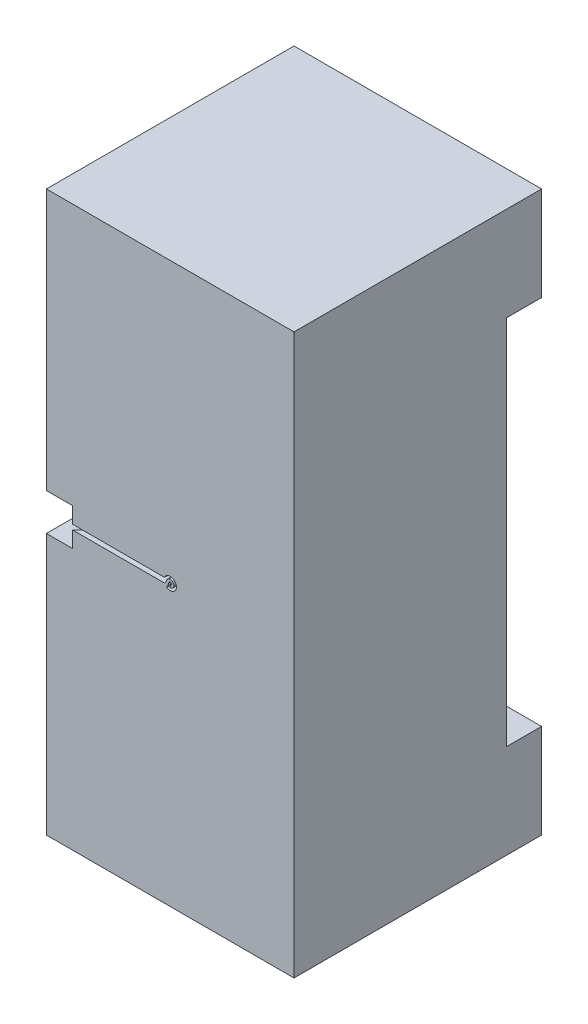
ISO-10303-21;
HEADER;
FILE_DESCRIPTION(('STEP AP214'),'2;1');
FILE_NAME('part.step','',(''),(''),'','','');
FILE_SCHEMA(('AUTOMOTIVE_DESIGN { 1 0 10303 214 1 1 1 1 }'));
ENDSEC;
DATA;
#1=APPLICATION_CONTEXT('core data for automotive mechanical design processes');
#2=APPLICATION_PROTOCOL_DEFINITION('international standard','automotive_design',2000,#1);
#3=PRODUCT_CONTEXT('',#1,'mechanical');
#4=PRODUCT('Part','Part','',(#3));
#5=PRODUCT_RELATED_PRODUCT_CATEGORY('part','',(#4));
#6=PRODUCT_DEFINITION_FORMATION('','',#4);
#7=PRODUCT_DEFINITION_CONTEXT('part definition',#1,'design');
#8=PRODUCT_DEFINITION('design','',#6,#7);
#9=PRODUCT_DEFINITION_SHAPE('','',#8);
#10=(LENGTH_UNIT() NAMED_UNIT(*) SI_UNIT(.MILLI.,.METRE.));
#11=(NAMED_UNIT(*) PLANE_ANGLE_UNIT() SI_UNIT($,.RADIAN.));
#12=(NAMED_UNIT(*) SI_UNIT($,.STERADIAN.) SOLID_ANGLE_UNIT());
#13=UNCERTAINTY_MEASURE_WITH_UNIT(LENGTH_MEASURE(1.E-05),#10,'distance_accuracy_value','');
#14=(GEOMETRIC_REPRESENTATION_CONTEXT(3) GLOBAL_UNCERTAINTY_ASSIGNED_CONTEXT((#13)) GLOBAL_UNIT_ASSIGNED_CONTEXT((#10,
#11,#12)) REPRESENTATION_CONTEXT('',''));
#15=CARTESIAN_POINT('',(0.,0.,0.));
#16=DIRECTION('',(0.,0.,1.));
#17=DIRECTION('',(1.,0.,0.));
#18=AXIS2_PLACEMENT_3D('',#15,#16,#17);
#19=CARTESIAN_POINT('',(0.,113.,42.5));
#20=DIRECTION('',(0.,0.,1.));
#21=DIRECTION('',(1.,0.,0.));
#22=AXIS2_PLACEMENT_3D('',#19,#20,#21);
#23=CYLINDRICAL_SURFACE('',#22,2.5);
#24=DIRECTION('',(0.,0.,1.));
#25=VECTOR('',#24,1.);
#26=CARTESIAN_POINT('',(-1.41841628653395,110.941336540836,37.3001972000835));
#27=LINE('',#26,#25);
#28=CARTESIAN_POINT('',(-1.41841628653394,110.941336540836,43.5));
#29=VERTEX_POINT('',#28);
#30=CARTESIAN_POINT('',(-1.41841628653395,110.941336540836,50.));
#31=VERTEX_POINT('',#30);
#32=EDGE_CURVE('E66',#29,#31,#27,.T.);
#33=ORIENTED_EDGE('',*,*,#32,.T.);
#34=CARTESIAN_POINT('',(0.,113.,50.));
#35=DIRECTION('',(0.,0.,1.));
#36=DIRECTION('',(1.,0.,0.));
#37=AXIS2_PLACEMENT_3D('',#34,#35,#36);
#38=CIRCLE('',#37,2.5);
#39=CARTESIAN_POINT('',(-2.29128784747792,114.,50.));
#40=VERTEX_POINT('',#39);
#41=EDGE_CURVE('E238',#31,#40,#38,.T.);
#42=ORIENTED_EDGE('',*,*,#41,.T.);
#43=DIRECTION('',(0.,0.,1.));
#44=VECTOR('',#43,1.);
#45=CARTESIAN_POINT('',(-2.29128784747792,114.,42.5));
#46=LINE('',#45,#44);
#47=CARTESIAN_POINT('',(-2.29128784747792,114.,42.5));
#48=VERTEX_POINT('',#47);
#49=EDGE_CURVE('E274',#48,#40,#46,.T.);
#50=ORIENTED_EDGE('',*,*,#49,.F.);
#51=CARTESIAN_POINT('',(0.,113.,42.5));
#52=DIRECTION('',(0.,0.,1.));
#53=DIRECTION('',(1.,0.,0.));
#54=AXIS2_PLACEMENT_3D('',#51,#52,#53);
#55=CIRCLE('',#54,2.5);
#56=CARTESIAN_POINT('',(-2.29128784747792,112.,42.5));
#57=VERTEX_POINT('',#56);
#58=EDGE_CURVE('E263',#57,#48,#55,.T.);
#59=ORIENTED_EDGE('',*,*,#58,.F.);
#60=DIRECTION('',(0.,0.,1.));
#61=VECTOR('',#60,1.);
#62=CARTESIAN_POINT('',(-2.29128784747792,112.,42.5));
#63=LINE('',#62,#61);
#64=CARTESIAN_POINT('',(-2.29128784747792,112.,43.5));
#65=VERTEX_POINT('',#64);
#66=EDGE_CURVE('E269',#57,#65,#63,.T.);
#67=ORIENTED_EDGE('',*,*,#66,.T.);
#68=CARTESIAN_POINT('',(0.,113.,43.5));
#69=DIRECTION('',(0.,0.,1.));
#70=DIRECTION('',(1.,0.,0.));
#71=AXIS2_PLACEMENT_3D('',#68,#69,#70);
#72=CIRCLE('',#71,2.5);
#73=EDGE_CURVE('E61',#65,#29,#72,.T.);
#74=ORIENTED_EDGE('',*,*,#73,.T.);
#75=EDGE_LOOP('',(#33,#42,#50,#59,#67,#74));
#76=FACE_BOUND('',#75,.T.);
#77=ADVANCED_FACE('F46',(#76),#23,.F.);
#78=CARTESIAN_POINT('',(43.6916485072176,120.5,-33.0850467894194));
#79=DIRECTION('',(0.707106781186548,0.,0.707106781186547));
#80=DIRECTION('',(0.707106781186547,0.,-0.707106781186548));
#81=AXIS2_PLACEMENT_3D('',#78,#79,#80);
#82=PLANE('',#81);
#83=DIRECTION('',(0.707106781186547,0.,-0.707106781186548));
#84=VECTOR('',#83,1.);
#85=CARTESIAN_POINT('',(43.6916485072176,114.,-33.0850467894193));
#86=LINE('',#85,#84);
#87=CARTESIAN_POINT('',(-39.3933982822017,114.,50.));
#88=VERTEX_POINT('',#87);
#89=CARTESIAN_POINT('',(-33.0850467894193,114.,43.6916485072175));
#90=VERTEX_POINT('',#89);
#91=EDGE_CURVE('E403',#88,#90,#86,.T.);
#92=ORIENTED_EDGE('',*,*,#91,.F.);
#93=DIRECTION('',(0.,-1.,0.));
#94=VECTOR('',#93,1.);
#95=CARTESIAN_POINT('',(-39.3933982822017,226.,50.));
#96=LINE('',#95,#94);
#97=CARTESIAN_POINT('',(-39.3933982822017,120.5,50.));
#98=VERTEX_POINT('',#97);
#99=EDGE_CURVE('E307',#98,#88,#96,.T.);
#100=ORIENTED_EDGE('',*,*,#99,.F.);
#101=DIRECTION('',(-0.707106781186547,0.,0.707106781186548));
#102=VECTOR('',#101,1.);
#103=CARTESIAN_POINT('',(43.6916485072176,120.5,-33.0850467894194));
#104=LINE('',#103,#102);
#105=CARTESIAN_POINT('',(-33.0850467894193,120.5,43.6916485072175));
#106=VERTEX_POINT('',#105);
#107=EDGE_CURVE('E293',#106,#98,#104,.T.);
#108=ORIENTED_EDGE('',*,*,#107,.F.);
#109=DIRECTION('',(0.,1.,0.));
#110=VECTOR('',#109,1.);
#111=CARTESIAN_POINT('',(-33.0850467894193,0.,43.6916485072175));
#112=LINE('',#111,#110);
#113=EDGE_CURVE('E393',#90,#106,#112,.T.);
#114=ORIENTED_EDGE('',*,*,#113,.F.);
#115=EDGE_LOOP('',(#92,#100,#108,#114));
#116=FACE_BOUND('',#115,.T.);
#117=ADVANCED_FACE('F457',(#116),#82,.F.);
#118=CARTESIAN_POINT('',(50.,226.,-50.));
#119=DIRECTION('',(-1.,0.,0.));
#120=DIRECTION('',(0.,0.,1.));
#121=AXIS2_PLACEMENT_3D('',#118,#119,#120);
#122=PLANE('',#121);
#123=DIRECTION('',(0.,-1.,0.));
#124=VECTOR('',#123,1.);
#125=CARTESIAN_POINT('',(50.,226.,-50.));
#126=LINE('',#125,#124);
#127=CARTESIAN_POINT('',(50.0000000000001,38.,-50.));
#128=VERTEX_POINT('',#127);
#129=CARTESIAN_POINT('',(50.,0.,-50.));
#130=VERTEX_POINT('',#129);
#131=EDGE_CURVE('E376',#128,#130,#126,.T.);
#132=ORIENTED_EDGE('',*,*,#131,.F.);
#133=DIRECTION('',(0.,0.,1.));
#134=VECTOR('',#133,1.);
#135=CARTESIAN_POINT('',(50.,38.,-50.));
#136=LINE('',#135,#134);
#137=CARTESIAN_POINT('',(50.,38.,-35.8578643762691));
#138=VERTEX_POINT('',#137);
#139=EDGE_CURVE('E344',#128,#138,#136,.T.);
#140=ORIENTED_EDGE('',*,*,#139,.T.);
#141=DIRECTION('',(0.,-1.,0.));
#142=VECTOR('',#141,1.);
#143=CARTESIAN_POINT('',(50.,226.,-35.8578643762692));
#144=LINE('',#143,#142);
#145=CARTESIAN_POINT('',(50.,188.,-35.8578643762691));
#146=VERTEX_POINT('',#145);
#147=EDGE_CURVE('E388',#146,#138,#144,.T.);
#148=ORIENTED_EDGE('',*,*,#147,.F.);
#149=DIRECTION('',(0.,0.,1.));
#150=VECTOR('',#149,1.);
#151=CARTESIAN_POINT('',(50.,188.,-50.));
#152=LINE('',#151,#150);
#153=CARTESIAN_POINT('',(50.0000000000001,188.,-50.));
#154=VERTEX_POINT('',#153);
#155=EDGE_CURVE('E342',#154,#146,#152,.T.);
#156=ORIENTED_EDGE('',*,*,#155,.F.);
#157=CARTESIAN_POINT('',(50.,226.,-50.));
#158=VERTEX_POINT('',#157);
#159=EDGE_CURVE('E377',#158,#154,#126,.T.);
#160=ORIENTED_EDGE('',*,*,#159,.F.);
#161=DIRECTION('',(0.,0.,-1.));
#162=VECTOR('',#161,1.);
#163=CARTESIAN_POINT('',(50.,226.,-50.));
#164=LINE('',#163,#162);
#165=CARTESIAN_POINT('',(50.,226.,50.));
#166=VERTEX_POINT('',#165);
#167=EDGE_CURVE('E348',#166,#158,#164,.T.);
#168=ORIENTED_EDGE('',*,*,#167,.F.);
#169=DIRECTION('',(0.,-1.,0.));
#170=VECTOR('',#169,1.);
#171=CARTESIAN_POINT('',(50.,226.,50.));
#172=LINE('',#171,#170);
#173=CARTESIAN_POINT('',(50.,0.,50.));
#174=VERTEX_POINT('',#173);
#175=EDGE_CURVE('E358',#166,#174,#172,.T.);
#176=ORIENTED_EDGE('',*,*,#175,.T.);
#177=DIRECTION('',(0.,0.,-1.));
#178=VECTOR('',#177,1.);
#179=CARTESIAN_POINT('',(50.,0.,-50.));
#180=LINE('',#179,#178);
#181=EDGE_CURVE('E347',#174,#130,#180,.T.);
#182=ORIENTED_EDGE('',*,*,#181,.T.);
#183=EDGE_LOOP('',(#132,#140,#148,#156,#160,#168,#176,#182));
#184=FACE_BOUND('',#183,.T.);
#185=ADVANCED_FACE('F48',(#184),#122,.F.);
#186=CARTESIAN_POINT('',(-50.,226.,-50.));
#187=DIRECTION('',(0.,0.,1.));
#188=DIRECTION('',(1.,0.,0.));
#189=AXIS2_PLACEMENT_3D('',#186,#187,#188);
#190=PLANE('',#189);
#191=DIRECTION('',(0.,-1.,0.));
#192=VECTOR('',#191,1.);
#193=CARTESIAN_POINT('',(35.857864376269,226.,-50.));
#194=LINE('',#193,#192);
#195=CARTESIAN_POINT('',(35.857864376269,188.,-50.));
#196=VERTEX_POINT('',#195);
#197=CARTESIAN_POINT('',(35.857864376269,38.,-50.));
#198=VERTEX_POINT('',#197);
#199=EDGE_CURVE('E380',#196,#198,#194,.T.);
#200=ORIENTED_EDGE('',*,*,#199,.T.);
#201=DIRECTION('',(1.,0.,0.));
#202=VECTOR('',#201,1.);
#203=CARTESIAN_POINT('',(-50.,38.,-50.));
#204=LINE('',#203,#202);
#205=EDGE_CURVE('E385',#198,#128,#204,.T.);
#206=ORIENTED_EDGE('',*,*,#205,.T.);
#207=ORIENTED_EDGE('',*,*,#131,.T.);
#208=DIRECTION('',(-1.,0.,0.));
#209=VECTOR('',#208,1.);
#210=CARTESIAN_POINT('',(-50.,0.,-50.));
#211=LINE('',#210,#209);
#212=CARTESIAN_POINT('',(-50.,0.,-50.));
#213=VERTEX_POINT('',#212);
#214=EDGE_CURVE('E361',#130,#213,#211,.T.);
#215=ORIENTED_EDGE('',*,*,#214,.T.);
#216=DIRECTION('',(0.,-1.,0.));
#217=VECTOR('',#216,1.);
#218=CARTESIAN_POINT('',(-50.,226.,-50.));
#219=LINE('',#218,#217);
#220=CARTESIAN_POINT('',(-50.,226.,-50.));
#221=VERTEX_POINT('',#220);
#222=EDGE_CURVE('E373',#221,#213,#219,.T.);
#223=ORIENTED_EDGE('',*,*,#222,.F.);
#224=DIRECTION('',(-1.,0.,0.));
#225=VECTOR('',#224,1.);
#226=CARTESIAN_POINT('',(-50.,226.,-50.));
#227=LINE('',#226,#225);
#228=EDGE_CURVE('E351',#158,#221,#227,.T.);
#229=ORIENTED_EDGE('',*,*,#228,.F.);
#230=ORIENTED_EDGE('',*,*,#159,.T.);
#231=DIRECTION('',(1.,0.,0.));
#232=VECTOR('',#231,1.);
#233=CARTESIAN_POINT('',(-50.,188.,-50.));
#234=LINE('',#233,#232);
#235=EDGE_CURVE('E383',#196,#154,#234,.T.);
#236=ORIENTED_EDGE('',*,*,#235,.F.);
#237=EDGE_LOOP('',(#200,#206,#207,#215,#223,#229,#230,#236));
#238=FACE_BOUND('',#237,.T.);
#239=ADVANCED_FACE('F509',(#238),#190,.F.);
#240=CARTESIAN_POINT('',(-50.,226.,-50.));
#241=DIRECTION('',(1.,0.,0.));
#242=DIRECTION('',(0.,0.,-1.));
#243=AXIS2_PLACEMENT_3D('',#240,#241,#242);
#244=PLANE('',#243);
#245=DIRECTION('',(0.,1.,0.));
#246=VECTOR('',#245,1.);
#247=CARTESIAN_POINT('',(-50.,226.,39.3933982822018));
#248=LINE('',#247,#246);
#249=CARTESIAN_POINT('',(-50.,105.5,39.3933982822018));
#250=VERTEX_POINT('',#249);
#251=CARTESIAN_POINT('',(-50.,120.5,39.3933982822018));
#252=VERTEX_POINT('',#251);
#253=EDGE_CURVE('E316',#250,#252,#248,.T.);
#254=ORIENTED_EDGE('',*,*,#253,.T.);
#255=DIRECTION('',(0.,0.,1.));
#256=VECTOR('',#255,1.);
#257=CARTESIAN_POINT('',(-50.,120.5,-50.));
#258=LINE('',#257,#256);
#259=CARTESIAN_POINT('',(-50.,120.5,50.));
#260=VERTEX_POINT('',#259);
#261=EDGE_CURVE('E313',#252,#260,#258,.T.);
#262=ORIENTED_EDGE('',*,*,#261,.T.);
#263=DIRECTION('',(0.,-1.,0.));
#264=VECTOR('',#263,1.);
#265=CARTESIAN_POINT('',(-50.,226.,50.));
#266=LINE('',#265,#264);
#267=CARTESIAN_POINT('',(-50.,226.,50.));
#268=VERTEX_POINT('',#267);
#269=EDGE_CURVE('E370',#268,#260,#266,.T.);
#270=ORIENTED_EDGE('',*,*,#269,.F.);
#271=DIRECTION('',(0.,0.,1.));
#272=VECTOR('',#271,1.);
#273=CARTESIAN_POINT('',(-50.,226.,-50.));
#274=LINE('',#273,#272);
#275=EDGE_CURVE('E354',#221,#268,#274,.T.);
#276=ORIENTED_EDGE('',*,*,#275,.F.);
#277=ORIENTED_EDGE('',*,*,#222,.T.);
#278=DIRECTION('',(0.,0.,1.));
#279=VECTOR('',#278,1.);
#280=CARTESIAN_POINT('',(-50.,0.,-50.));
#281=LINE('',#280,#279);
#282=CARTESIAN_POINT('',(-50.,0.,50.));
#283=VERTEX_POINT('',#282);
#284=EDGE_CURVE('E363',#213,#283,#281,.T.);
#285=ORIENTED_EDGE('',*,*,#284,.T.);
#286=CARTESIAN_POINT('',(-50.,105.5,50.));
#287=VERTEX_POINT('',#286);
#288=EDGE_CURVE('E369',#287,#283,#266,.T.);
#289=ORIENTED_EDGE('',*,*,#288,.F.);
#290=DIRECTION('',(0.,0.,-1.));
#291=VECTOR('',#290,1.);
#292=CARTESIAN_POINT('',(-50.,105.5,-50.));
#293=LINE('',#292,#291);
#294=EDGE_CURVE('E303',#287,#250,#293,.T.);
#295=ORIENTED_EDGE('',*,*,#294,.T.);
#296=EDGE_LOOP('',(#254,#262,#270,#276,#277,#285,#289,#295));
#297=FACE_BOUND('',#296,.T.);
#298=ADVANCED_FACE('F422',(#297),#244,.F.);
#299=CARTESIAN_POINT('',(-50.,226.,50.));
#300=DIRECTION('',(0.,0.,-1.));
#301=DIRECTION('',(-1.,0.,0.));
#302=AXIS2_PLACEMENT_3D('',#299,#300,#301);
#303=PLANE('',#302);
#304=ORIENTED_EDGE('',*,*,#41,.F.);
#305=CARTESIAN_POINT('',(-16.5329524743217,118.687508554055,50.));
#306=DIRECTION('',(0.,0.,1.));
#307=DIRECTION('',(1.,0.,0.));
#308=AXIS2_PLACEMENT_3D('',#305,#306,#307);
#309=CIRCLE('',#308,16.9838860403123);
#310=CARTESIAN_POINT('',(-0.472805428844651,113.162650012158,50.));
#311=VERTEX_POINT('',#310);
#312=EDGE_CURVE('E220',#311,#31,#309,.F.);
#313=ORIENTED_EDGE('',*,*,#312,.F.);
#314=CARTESIAN_POINT('',(0.,113.,50.));
#315=DIRECTION('',(0.,0.,1.));
#316=DIRECTION('',(1.,0.,0.));
#317=AXIS2_PLACEMENT_3D('',#314,#315,#316);
#318=CIRCLE('',#317,0.500000000000002);
#319=CARTESIAN_POINT('',(0.,112.5,50.));
#320=VERTEX_POINT('',#319);
#321=EDGE_CURVE('E228',#320,#311,#318,.T.);
#322=ORIENTED_EDGE('',*,*,#321,.F.);
#323=DIRECTION('',(0.,-1.,0.));
#324=VECTOR('',#323,1.);
#325=CARTESIAN_POINT('',(0.,0.,50.));
#326=LINE('',#325,#324);
#327=CARTESIAN_POINT('',(0.,111.5,50.));
#328=VERTEX_POINT('',#327);
#329=EDGE_CURVE('E234',#320,#328,#326,.T.);
#330=ORIENTED_EDGE('',*,*,#329,.T.);
#331=CARTESIAN_POINT('',(0.,113.,50.));
#332=DIRECTION('',(0.,0.,1.));
#333=DIRECTION('',(1.,0.,0.));
#334=AXIS2_PLACEMENT_3D('',#331,#332,#333);
#335=CIRCLE('',#334,1.5);
#336=CARTESIAN_POINT('',(-1.41841628653395,113.487950036474,50.));
#337=VERTEX_POINT('',#336);
#338=EDGE_CURVE('E244',#328,#337,#335,.T.);
#339=ORIENTED_EDGE('',*,*,#338,.T.);
#340=CARTESIAN_POINT('',(-5.54014798387023,114.905868845745,50.));
#341=DIRECTION('',(0.,0.,1.));
#342=DIRECTION('',(1.,0.,0.));
#343=AXIS2_PLACEMENT_3D('',#340,#341,#342);
#344=CIRCLE('',#343,4.35880326861745);
#345=CARTESIAN_POINT('',(-2.29128784747792,112.,50.));
#346=VERTEX_POINT('',#345);
#347=EDGE_CURVE('E225',#337,#346,#344,.F.);
#348=ORIENTED_EDGE('',*,*,#347,.T.);
#349=DIRECTION('',(1.,0.,0.));
#350=VECTOR('',#349,1.);
#351=CARTESIAN_POINT('',(5.7381964083116E-13,112.,50.));
#352=LINE('',#351,#350);
#353=CARTESIAN_POINT('',(-39.3933982822017,112.,50.));
#354=VERTEX_POINT('',#353);
#355=EDGE_CURVE('E270',#354,#346,#352,.T.);
#356=ORIENTED_EDGE('',*,*,#355,.F.);
#357=CARTESIAN_POINT('',(-39.3933982822017,105.5,50.));
#358=VERTEX_POINT('',#357);
#359=EDGE_CURVE('E306',#354,#358,#96,.T.);
#360=ORIENTED_EDGE('',*,*,#359,.T.);
#361=DIRECTION('',(-1.,0.,0.));
#362=VECTOR('',#361,1.);
#363=CARTESIAN_POINT('',(-50.,105.5,50.));
#364=LINE('',#363,#362);
#365=EDGE_CURVE('E292',#358,#287,#364,.T.);
#366=ORIENTED_EDGE('',*,*,#365,.T.);
#367=ORIENTED_EDGE('',*,*,#288,.T.);
#368=DIRECTION('',(1.,0.,0.));
#369=VECTOR('',#368,1.);
#370=CARTESIAN_POINT('',(-50.,0.,50.));
#371=LINE('',#370,#369);
#372=EDGE_CURVE('E352',#283,#174,#371,.T.);
#373=ORIENTED_EDGE('',*,*,#372,.T.);
#374=ORIENTED_EDGE('',*,*,#175,.F.);
#375=DIRECTION('',(1.,0.,0.));
#376=VECTOR('',#375,1.);
#377=CARTESIAN_POINT('',(-50.,226.,50.));
#378=LINE('',#377,#376);
#379=EDGE_CURVE('E356',#268,#166,#378,.T.);
#380=ORIENTED_EDGE('',*,*,#379,.F.);
#381=ORIENTED_EDGE('',*,*,#269,.T.);
#382=DIRECTION('',(1.,0.,0.));
#383=VECTOR('',#382,1.);
#384=CARTESIAN_POINT('',(-50.,120.5,50.));
#385=LINE('',#384,#383);
#386=EDGE_CURVE('E310',#260,#98,#385,.T.);
#387=ORIENTED_EDGE('',*,*,#386,.T.);
#388=ORIENTED_EDGE('',*,*,#99,.T.);
#389=DIRECTION('',(1.,0.,0.));
#390=VECTOR('',#389,1.);
#391=CARTESIAN_POINT('',(5.84066420131715E-13,114.,50.));
#392=LINE('',#391,#390);
#393=EDGE_CURVE('E264',#88,#40,#392,.T.);
#394=ORIENTED_EDGE('',*,*,#393,.T.);
#395=EDGE_LOOP('',(#304,#313,#322,#330,#339,#348,#356,#360,#366,#367,#373,#374,#380,#381,#387,
#388,#394));
#396=FACE_BOUND('',#395,.T.);
#397=ADVANCED_FACE('F236',(#396),#303,.F.);
#398=CARTESIAN_POINT('',(0.,226.,0.));
#399=DIRECTION('',(0.,1.,0.));
#400=DIRECTION('',(0.,0.,1.));
#401=AXIS2_PLACEMENT_3D('',#398,#399,#400);
#402=PLANE('',#401);
#403=ORIENTED_EDGE('',*,*,#167,.T.);
#404=ORIENTED_EDGE('',*,*,#228,.T.);
#405=ORIENTED_EDGE('',*,*,#275,.T.);
#406=ORIENTED_EDGE('',*,*,#379,.T.);
#407=EDGE_LOOP('',(#403,#404,#405,#406));
#408=FACE_BOUND('',#407,.T.);
#409=ADVANCED_FACE('F500',(#408),#402,.T.);
#410=CARTESIAN_POINT('',(0.,0.,0.));
#411=DIRECTION('',(0.,1.,0.));
#412=DIRECTION('',(0.,0.,1.));
#413=AXIS2_PLACEMENT_3D('',#410,#411,#412);
#414=PLANE('',#413);
#415=ORIENTED_EDGE('',*,*,#181,.F.);
#416=ORIENTED_EDGE('',*,*,#372,.F.);
#417=ORIENTED_EDGE('',*,*,#284,.F.);
#418=ORIENTED_EDGE('',*,*,#214,.F.);
#419=EDGE_LOOP('',(#415,#416,#417,#418));
#420=FACE_BOUND('',#419,.T.);
#421=ADVANCED_FACE('F495',(#420),#414,.F.);
#422=CARTESIAN_POINT('',(-31.317279836453,0.,45.4594154601839));
#423=DIRECTION('',(-0.707106781186548,0.,-0.707106781186547));
#424=DIRECTION('',(-0.707106781186547,0.,0.707106781186548));
#425=AXIS2_PLACEMENT_3D('',#422,#423,#424);
#426=PLANE('',#425);
#427=DIRECTION('',(-0.707106781186547,0.,0.707106781186548));
#428=VECTOR('',#427,1.);
#429=CARTESIAN_POINT('',(-31.3172798364527,112.,45.4594154601836));
#430=LINE('',#429,#428);
#431=CARTESIAN_POINT('',(-28.3578643762691,112.,42.5));
#432=VERTEX_POINT('',#431);
#433=CARTESIAN_POINT('',(-31.317279836453,112.,45.4594154601839));
#434=VERTEX_POINT('',#433);
#435=EDGE_CURVE('E286',#432,#434,#430,.T.);
#436=ORIENTED_EDGE('',*,*,#435,.F.);
#437=DIRECTION('',(0.,1.,0.));
#438=VECTOR('',#437,1.);
#439=CARTESIAN_POINT('',(-28.3578643762691,0.,42.5));
#440=LINE('',#439,#438);
#441=CARTESIAN_POINT('',(-28.3578643762691,114.,42.5));
#442=VERTEX_POINT('',#441);
#443=EDGE_CURVE('E13',#432,#442,#440,.T.);
#444=ORIENTED_EDGE('',*,*,#443,.T.);
#445=DIRECTION('',(-0.707106781186547,0.,0.707106781186548));
#446=VECTOR('',#445,1.);
#447=CARTESIAN_POINT('',(-31.3172798364527,114.,45.4594154601836));
#448=LINE('',#447,#446);
#449=CARTESIAN_POINT('',(-31.317279836453,114.,45.4594154601839));
#450=VERTEX_POINT('',#449);
#451=EDGE_CURVE('E280',#442,#450,#448,.T.);
#452=ORIENTED_EDGE('',*,*,#451,.T.);
#453=DIRECTION('',(0.,1.,0.));
#454=VECTOR('',#453,1.);
#455=CARTESIAN_POINT('',(-31.317279836453,0.,45.4594154601839));
#456=LINE('',#455,#454);
#457=CARTESIAN_POINT('',(-31.317279836453,188.,45.4594154601838));
#458=VERTEX_POINT('',#457);
#459=EDGE_CURVE('E322',#450,#458,#456,.T.);
#460=ORIENTED_EDGE('',*,*,#459,.T.);
#461=DIRECTION('',(0.707106781186547,0.,-0.707106781186548));
#462=VECTOR('',#461,1.);
#463=CARTESIAN_POINT('',(-31.317279836453,188.,45.4594154601838));
#464=LINE('',#463,#462);
#465=EDGE_CURVE('E336',#458,#146,#464,.T.);
#466=ORIENTED_EDGE('',*,*,#465,.T.);
#467=ORIENTED_EDGE('',*,*,#147,.T.);
#468=DIRECTION('',(0.707106781186547,0.,-0.707106781186548));
#469=VECTOR('',#468,1.);
#470=CARTESIAN_POINT('',(-31.317279836453,38.,45.4594154601839));
#471=LINE('',#470,#469);
#472=CARTESIAN_POINT('',(-31.317279836453,38.,45.4594154601839));
#473=VERTEX_POINT('',#472);
#474=EDGE_CURVE('E339',#473,#138,#471,.T.);
#475=ORIENTED_EDGE('',*,*,#474,.F.);
#476=EDGE_CURVE('E323',#473,#434,#456,.T.);
#477=ORIENTED_EDGE('',*,*,#476,.T.);
#478=EDGE_LOOP('',(#436,#444,#452,#460,#466,#467,#475,#477));
#479=FACE_BOUND('',#478,.T.);
#480=ADVANCED_FACE('F492',(#479),#426,.T.);
#481=CARTESIAN_POINT('',(-38.3883476483184,38.,38.3883476483184));
#482=DIRECTION('',(0.,-1.,0.));
#483=DIRECTION('',(1.,0.,0.));
#484=AXIS2_PLACEMENT_3D('',#481,#482,#483);
#485=PLANE('',#484);
#486=ORIENTED_EDGE('',*,*,#205,.F.);
#487=DIRECTION('',(0.707106781186547,0.,-0.707106781186548));
#488=VECTOR('',#487,1.);
#489=CARTESIAN_POINT('',(-45.4594154601839,38.,31.3172798364529));
#490=LINE('',#489,#488);
#491=CARTESIAN_POINT('',(-45.4594154601839,38.,31.3172798364529));
#492=VERTEX_POINT('',#491);
#493=EDGE_CURVE('E331',#492,#198,#490,.T.);
#494=ORIENTED_EDGE('',*,*,#493,.F.);
#495=DIRECTION('',(-0.707106781186548,0.,-0.707106781186548));
#496=VECTOR('',#495,1.);
#497=CARTESIAN_POINT('',(-38.3883476483184,38.,38.3883476483184));
#498=LINE('',#497,#496);
#499=EDGE_CURVE('E319',#473,#492,#498,.T.);
#500=ORIENTED_EDGE('',*,*,#499,.F.);
#501=ORIENTED_EDGE('',*,*,#474,.T.);
#502=ORIENTED_EDGE('',*,*,#139,.F.);
#503=EDGE_LOOP('',(#486,#494,#500,#501,#502));
#504=FACE_BOUND('',#503,.T.);
#505=ADVANCED_FACE('F490',(#504),#485,.F.);
#506=CARTESIAN_POINT('',(-38.3883476483186,188.,38.3883476483182));
#507=DIRECTION('',(0.,-1.,0.));
#508=DIRECTION('',(1.,0.,0.));
#509=AXIS2_PLACEMENT_3D('',#506,#507,#508);
#510=PLANE('',#509);
#511=ORIENTED_EDGE('',*,*,#155,.T.);
#512=ORIENTED_EDGE('',*,*,#465,.F.);
#513=DIRECTION('',(-0.707106781186548,0.,-0.707106781186548));
#514=VECTOR('',#513,1.);
#515=CARTESIAN_POINT('',(-38.3883476483186,188.,38.3883476483182));
#516=LINE('',#515,#514);
#517=CARTESIAN_POINT('',(-45.4594154601839,188.,31.3172798364529));
#518=VERTEX_POINT('',#517);
#519=EDGE_CURVE('E326',#458,#518,#516,.T.);
#520=ORIENTED_EDGE('',*,*,#519,.T.);
#521=DIRECTION('',(0.707106781186547,0.,-0.707106781186548));
#522=VECTOR('',#521,1.);
#523=CARTESIAN_POINT('',(-45.4594154601839,188.,31.3172798364529));
#524=LINE('',#523,#522);
#525=EDGE_CURVE('E333',#518,#196,#524,.T.);
#526=ORIENTED_EDGE('',*,*,#525,.T.);
#527=ORIENTED_EDGE('',*,*,#235,.T.);
#528=EDGE_LOOP('',(#511,#512,#520,#526,#527));
#529=FACE_BOUND('',#528,.T.);
#530=ADVANCED_FACE('F486',(#529),#510,.T.);
#531=CARTESIAN_POINT('',(-45.4594154601839,0.,31.3172798364529));
#532=DIRECTION('',(-0.707106781186548,0.,-0.707106781186547));
#533=DIRECTION('',(-0.707106781186547,0.,0.707106781186548));
#534=AXIS2_PLACEMENT_3D('',#531,#532,#533);
#535=PLANE('',#534);
#536=ORIENTED_EDGE('',*,*,#525,.F.);
#537=DIRECTION('',(0.,1.,0.));
#538=VECTOR('',#537,1.);
#539=CARTESIAN_POINT('',(-45.4594154601839,0.,31.3172798364529));
#540=LINE('',#539,#538);
#541=EDGE_CURVE('E328',#492,#518,#540,.T.);
#542=ORIENTED_EDGE('',*,*,#541,.F.);
#543=ORIENTED_EDGE('',*,*,#493,.T.);
#544=ORIENTED_EDGE('',*,*,#199,.F.);
#545=EDGE_LOOP('',(#536,#542,#543,#544));
#546=FACE_BOUND('',#545,.T.);
#547=ADVANCED_FACE('F483',(#546),#535,.F.);
#548=CARTESIAN_POINT('',(-38.3883476483184,0.,38.3883476483184));
#549=DIRECTION('',(-0.707106781186548,0.,0.707106781186548));
#550=DIRECTION('',(0.707106781186548,0.,0.707106781186548));
#551=AXIS2_PLACEMENT_3D('',#548,#549,#550);
#552=PLANE('',#551);
#553=CARTESIAN_POINT('',(-33.0850467894193,105.5,43.6916485072175));
#554=VERTEX_POINT('',#553);
#555=CARTESIAN_POINT('',(-33.0850467894193,112.,43.6916485072175));
#556=VERTEX_POINT('',#555);
#557=EDGE_CURVE('E394',#554,#556,#112,.T.);
#558=ORIENTED_EDGE('',*,*,#557,.T.);
#559=DIRECTION('',(0.707106781186548,0.,0.707106781186548));
#560=VECTOR('',#559,1.);
#561=CARTESIAN_POINT('',(-38.3883476483181,112.,38.3883476483187));
#562=LINE('',#561,#560);
#563=EDGE_CURVE('E283',#556,#434,#562,.T.);
#564=ORIENTED_EDGE('',*,*,#563,.T.);
#565=ORIENTED_EDGE('',*,*,#476,.F.);
#566=ORIENTED_EDGE('',*,*,#499,.T.);
#567=ORIENTED_EDGE('',*,*,#541,.T.);
#568=ORIENTED_EDGE('',*,*,#519,.F.);
#569=ORIENTED_EDGE('',*,*,#459,.F.);
#570=DIRECTION('',(0.707106781186548,0.,0.707106781186548));
#571=VECTOR('',#570,1.);
#572=CARTESIAN_POINT('',(-38.3883476483181,114.,38.3883476483187));
#573=LINE('',#572,#571);
#574=EDGE_CURVE('E277',#90,#450,#573,.T.);
#575=ORIENTED_EDGE('',*,*,#574,.F.);
#576=ORIENTED_EDGE('',*,*,#113,.T.);
#577=DIRECTION('',(-0.707106781186548,0.,-0.707106781186548));
#578=VECTOR('',#577,1.);
#579=CARTESIAN_POINT('',(-38.3883476483184,120.5,38.3883476483184));
#580=LINE('',#579,#578);
#581=CARTESIAN_POINT('',(-43.6916485072175,120.5,33.0850467894193));
#582=VERTEX_POINT('',#581);
#583=EDGE_CURVE('E397',#106,#582,#580,.T.);
#584=ORIENTED_EDGE('',*,*,#583,.T.);
#585=DIRECTION('',(0.,-1.,0.));
#586=VECTOR('',#585,1.);
#587=CARTESIAN_POINT('',(-43.6916485072175,0.,33.0850467894193));
#588=LINE('',#587,#586);
#589=CARTESIAN_POINT('',(-43.6916485072175,105.5,33.0850467894193));
#590=VERTEX_POINT('',#589);
#591=EDGE_CURVE('E400',#582,#590,#588,.T.);
#592=ORIENTED_EDGE('',*,*,#591,.T.);
#593=DIRECTION('',(0.707106781186548,0.,0.707106781186548));
#594=VECTOR('',#593,1.);
#595=CARTESIAN_POINT('',(-38.3883476483184,105.5,38.3883476483184));
#596=LINE('',#595,#594);
#597=EDGE_CURVE('E390',#590,#554,#596,.T.);
#598=ORIENTED_EDGE('',*,*,#597,.T.);
#599=EDGE_LOOP('',(#558,#564,#565,#566,#567,#568,#569,#575,#576,#584,#592,#598));
#600=FACE_BOUND('',#599,.T.);
#601=ADVANCED_FACE('F412',(#600),#552,.F.);
#602=CARTESIAN_POINT('',(33.0850467894194,120.5,-43.6916485072176));
#603=DIRECTION('',(-0.707106781186548,0.,-0.707106781186547));
#604=DIRECTION('',(-0.707106781186547,0.,0.707106781186548));
#605=AXIS2_PLACEMENT_3D('',#602,#603,#604);
#606=PLANE('',#605);
#607=DIRECTION('',(-0.707106781186547,0.,0.707106781186548));
#608=VECTOR('',#607,1.);
#609=CARTESIAN_POINT('',(33.0850467894194,105.5,-43.6916485072176));
#610=LINE('',#609,#608);
#611=EDGE_CURVE('E288',#590,#250,#610,.T.);
#612=ORIENTED_EDGE('',*,*,#611,.F.);
#613=ORIENTED_EDGE('',*,*,#591,.F.);
#614=DIRECTION('',(-0.707106781186547,0.,0.707106781186548));
#615=VECTOR('',#614,1.);
#616=CARTESIAN_POINT('',(33.0850467894194,120.5,-43.6916485072176));
#617=LINE('',#616,#615);
#618=EDGE_CURVE('E289',#582,#252,#617,.T.);
#619=ORIENTED_EDGE('',*,*,#618,.T.);
#620=ORIENTED_EDGE('',*,*,#253,.F.);
#621=EDGE_LOOP('',(#612,#613,#619,#620));
#622=FACE_BOUND('',#621,.T.);
#623=ADVANCED_FACE('F419',(#622),#606,.F.);
#624=CARTESIAN_POINT('',(43.6916485072176,120.5,-33.0850467894194));
#625=DIRECTION('',(0.,1.,0.));
#626=DIRECTION('',(0.,0.,1.));
#627=AXIS2_PLACEMENT_3D('',#624,#625,#626);
#628=PLANE('',#627);
#629=ORIENTED_EDGE('',*,*,#618,.F.);
#630=ORIENTED_EDGE('',*,*,#583,.F.);
#631=ORIENTED_EDGE('',*,*,#107,.T.);
#632=ORIENTED_EDGE('',*,*,#386,.F.);
#633=ORIENTED_EDGE('',*,*,#261,.F.);
#634=EDGE_LOOP('',(#629,#630,#631,#632,#633));
#635=FACE_BOUND('',#634,.T.);
#636=ADVANCED_FACE('F472',(#635),#628,.F.);
#637=ORIENTED_EDGE('',*,*,#359,.F.);
#638=DIRECTION('',(0.707106781186547,0.,-0.707106781186548));
#639=VECTOR('',#638,1.);
#640=CARTESIAN_POINT('',(43.6916485072176,112.,-33.0850467894193));
#641=LINE('',#640,#639);
#642=EDGE_CURVE('E54',#354,#556,#641,.T.);
#643=ORIENTED_EDGE('',*,*,#642,.T.);
#644=ORIENTED_EDGE('',*,*,#557,.F.);
#645=DIRECTION('',(-0.707106781186547,0.,0.707106781186548));
#646=VECTOR('',#645,1.);
#647=CARTESIAN_POINT('',(43.6916485072176,105.5,-33.0850467894194));
#648=LINE('',#647,#646);
#649=EDGE_CURVE('E296',#554,#358,#648,.T.);
#650=ORIENTED_EDGE('',*,*,#649,.T.);
#651=EDGE_LOOP('',(#637,#643,#644,#650));
#652=FACE_BOUND('',#651,.T.);
#653=ADVANCED_FACE('F408',(#652),#82,.F.);
#654=CARTESIAN_POINT('',(43.6916485072176,105.5,-33.0850467894194));
#655=DIRECTION('',(0.,-1.,0.));
#656=DIRECTION('',(0.,0.,-1.));
#657=AXIS2_PLACEMENT_3D('',#654,#655,#656);
#658=PLANE('',#657);
#659=ORIENTED_EDGE('',*,*,#365,.F.);
#660=ORIENTED_EDGE('',*,*,#649,.F.);
#661=ORIENTED_EDGE('',*,*,#597,.F.);
#662=ORIENTED_EDGE('',*,*,#611,.T.);
#663=ORIENTED_EDGE('',*,*,#294,.F.);
#664=EDGE_LOOP('',(#659,#660,#661,#662,#663));
#665=FACE_BOUND('',#664,.T.);
#666=ADVANCED_FACE('F417',(#665),#658,.F.);
#667=CARTESIAN_POINT('',(5.7381964083116E-13,112.,42.5));
#668=DIRECTION('',(0.,-1.,0.));
#669=DIRECTION('',(1.,0.,0.));
#670=AXIS2_PLACEMENT_3D('',#667,#668,#669);
#671=PLANE('',#670);
#672=ORIENTED_EDGE('',*,*,#435,.T.);
#673=ORIENTED_EDGE('',*,*,#563,.F.);
#674=ORIENTED_EDGE('',*,*,#642,.F.);
#675=ORIENTED_EDGE('',*,*,#355,.T.);
#676=DIRECTION('',(0.,0.,1.));
#677=VECTOR('',#676,1.);
#678=CARTESIAN_POINT('',(-2.29128784747792,112.,37.3001972000835));
#679=LINE('',#678,#677);
#680=EDGE_CURVE('E251',#65,#346,#679,.T.);
#681=ORIENTED_EDGE('',*,*,#680,.F.);
#682=ORIENTED_EDGE('',*,*,#66,.F.);
#683=DIRECTION('',(1.,0.,0.));
#684=VECTOR('',#683,1.);
#685=CARTESIAN_POINT('',(5.7381964083116E-13,112.,42.5));
#686=LINE('',#685,#684);
#687=EDGE_CURVE('E261',#432,#57,#686,.T.);
#688=ORIENTED_EDGE('',*,*,#687,.F.);
#689=EDGE_LOOP('',(#672,#673,#674,#675,#681,#682,#688));
#690=FACE_BOUND('',#689,.T.);
#691=ADVANCED_FACE('F427',(#690),#671,.F.);
#692=CARTESIAN_POINT('',(5.84066420131715E-13,114.,42.5));
#693=DIRECTION('',(0.,-1.,0.));
#694=DIRECTION('',(1.,0.,0.));
#695=AXIS2_PLACEMENT_3D('',#692,#693,#694);
#696=PLANE('',#695);
#697=DIRECTION('',(1.,0.,0.));
#698=VECTOR('',#697,1.);
#699=CARTESIAN_POINT('',(5.84066420131715E-13,114.,42.5));
#700=LINE('',#699,#698);
#701=EDGE_CURVE('E267',#442,#48,#700,.T.);
#702=ORIENTED_EDGE('',*,*,#701,.T.);
#703=ORIENTED_EDGE('',*,*,#49,.T.);
#704=ORIENTED_EDGE('',*,*,#393,.F.);
#705=ORIENTED_EDGE('',*,*,#91,.T.);
#706=ORIENTED_EDGE('',*,*,#574,.T.);
#707=ORIENTED_EDGE('',*,*,#451,.F.);
#708=EDGE_LOOP('',(#702,#703,#704,#705,#706,#707));
#709=FACE_BOUND('',#708,.T.);
#710=ADVANCED_FACE('F468',(#709),#696,.T.);
#711=CARTESIAN_POINT('',(0.,0.,42.5));
#712=DIRECTION('',(0.,0.,1.));
#713=DIRECTION('',(1.,0.,0.));
#714=AXIS2_PLACEMENT_3D('',#711,#712,#713);
#715=PLANE('',#714);
#716=ORIENTED_EDGE('',*,*,#687,.T.);
#717=ORIENTED_EDGE('',*,*,#58,.T.);
#718=ORIENTED_EDGE('',*,*,#701,.F.);
#719=ORIENTED_EDGE('',*,*,#443,.F.);
#720=EDGE_LOOP('',(#716,#717,#718,#719));
#721=FACE_BOUND('',#720,.T.);
#722=ADVANCED_FACE('F543',(#721),#715,.T.);
#723=CARTESIAN_POINT('',(0.,113.,37.3001972000835));
#724=DIRECTION('',(0.,0.,1.));
#725=DIRECTION('',(1.,0.,0.));
#726=AXIS2_PLACEMENT_3D('',#723,#724,#725);
#727=CYLINDRICAL_SURFACE('',#726,0.500000000000002);
#728=DIRECTION('',(0.,0.,1.));
#729=VECTOR('',#728,1.);
#730=CARTESIAN_POINT('',(-0.472805428844651,113.162650012158,37.3001972000835));
#731=LINE('',#730,#729);
#732=CARTESIAN_POINT('',(-0.472805428844651,113.162650012158,43.5));
#733=VERTEX_POINT('',#732);
#734=EDGE_CURVE('E216',#733,#311,#731,.T.);
#735=ORIENTED_EDGE('',*,*,#734,.F.);
#736=CARTESIAN_POINT('',(0.,113.,43.5));
#737=DIRECTION('',(0.,0.,1.));
#738=DIRECTION('',(1.,0.,0.));
#739=AXIS2_PLACEMENT_3D('',#736,#737,#738);
#740=CIRCLE('',#739,0.500000000000002);
#741=CARTESIAN_POINT('',(0.,112.5,43.5));
#742=VERTEX_POINT('',#741);
#743=EDGE_CURVE('E250',#733,#742,#740,.F.);
#744=ORIENTED_EDGE('',*,*,#743,.T.);
#745=DIRECTION('',(0.,0.,1.));
#746=VECTOR('',#745,1.);
#747=CARTESIAN_POINT('',(0.,112.5,37.3001972000835));
#748=LINE('',#747,#746);
#749=EDGE_CURVE('E224',#742,#320,#748,.T.);
#750=ORIENTED_EDGE('',*,*,#749,.T.);
#751=ORIENTED_EDGE('',*,*,#321,.T.);
#752=EDGE_LOOP('',(#735,#744,#750,#751));
#753=FACE_BOUND('',#752,.T.);
#754=ADVANCED_FACE('F229',(#753),#727,.F.);
#755=CARTESIAN_POINT('',(0.,0.,37.3001972000835));
#756=DIRECTION('',(-1.,0.,0.));
#757=DIRECTION('',(0.,-1.,0.));
#758=AXIS2_PLACEMENT_3D('',#755,#756,#757);
#759=PLANE('',#758);
#760=DIRECTION('',(0.,1.,0.));
#761=VECTOR('',#760,1.);
#762=CARTESIAN_POINT('',(0.,0.,43.5));
#763=LINE('',#762,#761);
#764=CARTESIAN_POINT('',(0.,111.5,43.5));
#765=VERTEX_POINT('',#764);
#766=EDGE_CURVE('E260',#765,#742,#763,.T.);
#767=ORIENTED_EDGE('',*,*,#766,.F.);
#768=DIRECTION('',(0.,0.,1.));
#769=VECTOR('',#768,1.);
#770=CARTESIAN_POINT('',(0.,111.5,37.3001972000835));
#771=LINE('',#770,#769);
#772=EDGE_CURVE('E256',#765,#328,#771,.T.);
#773=ORIENTED_EDGE('',*,*,#772,.T.);
#774=ORIENTED_EDGE('',*,*,#329,.F.);
#775=ORIENTED_EDGE('',*,*,#749,.F.);
#776=EDGE_LOOP('',(#767,#773,#774,#775));
#777=FACE_BOUND('',#776,.T.);
#778=ADVANCED_FACE('F444',(#777),#759,.T.);
#779=CARTESIAN_POINT('',(0.,113.,37.3001972000835));
#780=DIRECTION('',(0.,0.,1.));
#781=DIRECTION('',(1.,0.,0.));
#782=AXIS2_PLACEMENT_3D('',#779,#780,#781);
#783=CYLINDRICAL_SURFACE('',#782,1.5);
#784=CARTESIAN_POINT('',(0.,113.,43.5));
#785=DIRECTION('',(0.,0.,1.));
#786=DIRECTION('',(1.,0.,0.));
#787=AXIS2_PLACEMENT_3D('',#784,#785,#786);
#788=CIRCLE('',#787,1.5);
#789=CARTESIAN_POINT('',(-1.41841628653395,113.487950036474,43.5));
#790=VERTEX_POINT('',#789);
#791=EDGE_CURVE('E436',#790,#765,#788,.F.);
#792=ORIENTED_EDGE('',*,*,#791,.F.);
#793=DIRECTION('',(0.,0.,1.));
#794=VECTOR('',#793,1.);
#795=CARTESIAN_POINT('',(-1.41841628653395,113.487950036474,37.3001972000835));
#796=LINE('',#795,#794);
#797=EDGE_CURVE('E254',#790,#337,#796,.T.);
#798=ORIENTED_EDGE('',*,*,#797,.T.);
#799=ORIENTED_EDGE('',*,*,#338,.F.);
#800=ORIENTED_EDGE('',*,*,#772,.F.);
#801=EDGE_LOOP('',(#792,#798,#799,#800));
#802=FACE_BOUND('',#801,.T.);
#803=ADVANCED_FACE('F447',(#802),#783,.T.);
#804=CARTESIAN_POINT('',(-5.54014798387023,114.905868845745,37.3001972000835));
#805=DIRECTION('',(0.,0.,1.));
#806=DIRECTION('',(1.,0.,0.));
#807=AXIS2_PLACEMENT_3D('',#804,#805,#806);
#808=CYLINDRICAL_SURFACE('',#807,4.35880326861745);
#809=CARTESIAN_POINT('',(-5.54014798387023,114.905868845745,43.5));
#810=DIRECTION('',(0.,0.,1.));
#811=DIRECTION('',(1.,0.,0.));
#812=AXIS2_PLACEMENT_3D('',#809,#810,#811);
#813=CIRCLE('',#812,4.35880326861745);
#814=EDGE_CURVE('E433',#65,#790,#813,.T.);
#815=ORIENTED_EDGE('',*,*,#814,.F.);
#816=ORIENTED_EDGE('',*,*,#680,.T.);
#817=ORIENTED_EDGE('',*,*,#347,.F.);
#818=ORIENTED_EDGE('',*,*,#797,.F.);
#819=EDGE_LOOP('',(#815,#816,#817,#818));
#820=FACE_BOUND('',#819,.T.);
#821=ADVANCED_FACE('F431',(#820),#808,.F.);
#822=CARTESIAN_POINT('',(-16.5329524743217,118.687508554055,37.3001972000835));
#823=DIRECTION('',(0.,0.,1.));
#824=DIRECTION('',(1.,0.,0.));
#825=AXIS2_PLACEMENT_3D('',#822,#823,#824);
#826=CYLINDRICAL_SURFACE('',#825,16.9838860403123);
#827=ORIENTED_EDGE('',*,*,#32,.F.);
#828=CARTESIAN_POINT('',(-16.5329524743217,118.687508554055,43.5));
#829=DIRECTION('',(0.,0.,1.));
#830=DIRECTION('',(1.,0.,0.));
#831=AXIS2_PLACEMENT_3D('',#828,#829,#830);
#832=CIRCLE('',#831,16.9838860403123);
#833=EDGE_CURVE('E221',#29,#733,#832,.T.);
#834=ORIENTED_EDGE('',*,*,#833,.T.);
#835=ORIENTED_EDGE('',*,*,#734,.T.);
#836=ORIENTED_EDGE('',*,*,#312,.T.);
#837=EDGE_LOOP('',(#827,#834,#835,#836));
#838=FACE_BOUND('',#837,.T.);
#839=ADVANCED_FACE('F218',(#838),#826,.T.);
#840=CARTESIAN_POINT('',(0.,0.,43.5));
#841=DIRECTION('',(0.,0.,1.));
#842=DIRECTION('',(1.,0.,0.));
#843=AXIS2_PLACEMENT_3D('',#840,#841,#842);
#844=PLANE('',#843);
#845=ORIENTED_EDGE('',*,*,#73,.F.);
#846=ORIENTED_EDGE('',*,*,#814,.T.);
#847=ORIENTED_EDGE('',*,*,#791,.T.);
#848=ORIENTED_EDGE('',*,*,#766,.T.);
#849=ORIENTED_EDGE('',*,*,#743,.F.);
#850=ORIENTED_EDGE('',*,*,#833,.F.);
#851=EDGE_LOOP('',(#845,#846,#847,#848,#849,#850));
#852=FACE_BOUND('',#851,.T.);
#853=ADVANCED_FACE('F441',(#852),#844,.F.);
#854=CLOSED_SHELL('',(#77,#117,#185,#239,#298,#397,#409,#421,#480,#505,#530,#547,#601,#623,#636,
#653,#666,#691,#710,#722,#754,#778,#803,#821,#839,#853));
#855=MANIFOLD_SOLID_BREP('B2',#854);
#856=ADVANCED_BREP_SHAPE_REPRESENTATION('',(#18,#855),#14);
#857=SHAPE_DEFINITION_REPRESENTATION(#9,#856);
ENDSEC;
END-ISO-10303-21;
